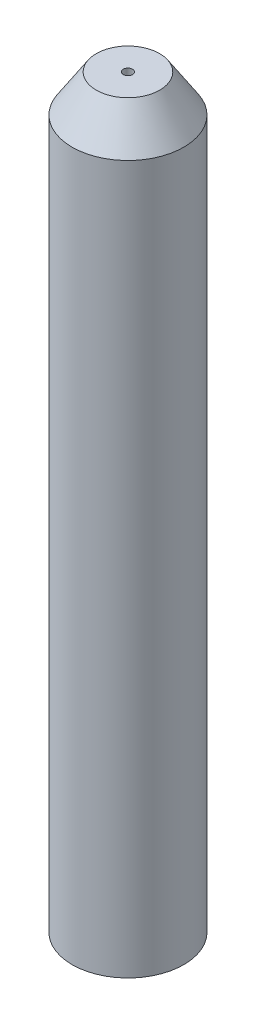
ISO-10303-21;
HEADER;
FILE_DESCRIPTION(('STEP AP214'),'2;1');
FILE_NAME('part.step','',(''),(''),'','','');
FILE_SCHEMA(('AUTOMOTIVE_DESIGN { 1 0 10303 214 1 1 1 1 }'));
ENDSEC;
DATA;
#1=APPLICATION_CONTEXT('core data for automotive mechanical design processes');
#2=APPLICATION_PROTOCOL_DEFINITION('international standard','automotive_design',2000,#1);
#3=PRODUCT_CONTEXT('',#1,'mechanical');
#4=PRODUCT('Part','Part','',(#3));
#5=PRODUCT_RELATED_PRODUCT_CATEGORY('part','',(#4));
#6=PRODUCT_DEFINITION_FORMATION('','',#4);
#7=PRODUCT_DEFINITION_CONTEXT('part definition',#1,'design');
#8=PRODUCT_DEFINITION('design','',#6,#7);
#9=PRODUCT_DEFINITION_SHAPE('','',#8);
#10=(LENGTH_UNIT() NAMED_UNIT(*) SI_UNIT(.MILLI.,.METRE.));
#11=(NAMED_UNIT(*) PLANE_ANGLE_UNIT() SI_UNIT($,.RADIAN.));
#12=(NAMED_UNIT(*) SI_UNIT($,.STERADIAN.) SOLID_ANGLE_UNIT());
#13=UNCERTAINTY_MEASURE_WITH_UNIT(LENGTH_MEASURE(1.E-05),#10,'distance_accuracy_value','');
#14=(GEOMETRIC_REPRESENTATION_CONTEXT(3) GLOBAL_UNCERTAINTY_ASSIGNED_CONTEXT((#13)) GLOBAL_UNIT_ASSIGNED_CONTEXT((#10,
#11,#12)) REPRESENTATION_CONTEXT('',''));
#15=CARTESIAN_POINT('',(0.,0.,0.));
#16=DIRECTION('',(0.,0.,1.));
#17=DIRECTION('',(1.,0.,0.));
#18=AXIS2_PLACEMENT_3D('',#15,#16,#17);
#19=CARTESIAN_POINT('',(0.,40.,0.));
#20=DIRECTION('',(0.,-1.,0.));
#21=DIRECTION('',(0.,0.,1.));
#22=AXIS2_PLACEMENT_3D('',#19,#20,#21);
#23=CONICAL_SURFACE('',#22,0.25,0.0523598775598299);
#24=CARTESIAN_POINT('',(0.,0.,0.));
#25=DIRECTION('',(0.,1.,0.));
#26=DIRECTION('',(0.,0.,1.));
#27=AXIS2_PLACEMENT_3D('',#24,#25,#26);
#28=CIRCLE('',#27,2.34631117132165);
#29=CARTESIAN_POINT('',(0.,0.,2.34631117132165));
#30=VERTEX_POINT('',#29);
#31=EDGE_CURVE('E46',#30,#30,#28,.T.);
#32=ORIENTED_EDGE('',*,*,#31,.F.);
#33=EDGE_LOOP('',(#32));
#34=FACE_BOUND('',#33,.T.);
#35=CARTESIAN_POINT('',(0.,20.,0.));
#36=DIRECTION('',(0.,1.,0.));
#37=DIRECTION('',(0.,0.,1.));
#38=AXIS2_PLACEMENT_3D('',#35,#36,#37);
#39=CIRCLE('',#38,1.29815558566082);
#40=CARTESIAN_POINT('',(0.,20.,1.29815558566082));
#41=VERTEX_POINT('',#40);
#42=EDGE_CURVE('E49',#41,#41,#39,.F.);
#43=ORIENTED_EDGE('',*,*,#42,.F.);
#44=EDGE_LOOP('',(#43));
#45=FACE_BOUND('',#44,.T.);
#46=ADVANCED_FACE('F31',(#34,#45),#23,.F.);
#47=CARTESIAN_POINT('',(0.,40.,0.));
#48=DIRECTION('',(0.,-1.,0.));
#49=DIRECTION('',(0.,0.,-1.));
#50=AXIS2_PLACEMENT_3D('',#47,#48,#49);
#51=CYLINDRICAL_SURFACE('',#50,3.);
#52=CARTESIAN_POINT('',(0.,38.,0.));
#53=DIRECTION('',(0.,1.,0.));
#54=DIRECTION('',(0.,0.,1.));
#55=AXIS2_PLACEMENT_3D('',#52,#53,#54);
#56=CIRCLE('',#55,3.);
#57=CARTESIAN_POINT('',(0.,38.,3.));
#58=VERTEX_POINT('',#57);
#59=EDGE_CURVE('E10',#58,#58,#56,.F.);
#60=ORIENTED_EDGE('',*,*,#59,.T.);
#61=EDGE_LOOP('',(#60));
#62=FACE_BOUND('',#61,.T.);
#63=CARTESIAN_POINT('',(0.,0.,0.));
#64=DIRECTION('',(0.,1.,0.));
#65=DIRECTION('',(0.,0.,1.));
#66=AXIS2_PLACEMENT_3D('',#63,#64,#65);
#67=CIRCLE('',#66,3.);
#68=CARTESIAN_POINT('',(0.,0.,3.));
#69=VERTEX_POINT('',#68);
#70=EDGE_CURVE('E42',#69,#69,#67,.T.);
#71=ORIENTED_EDGE('',*,*,#70,.T.);
#72=EDGE_LOOP('',(#71));
#73=FACE_BOUND('',#72,.T.);
#74=ADVANCED_FACE('F66',(#62,#73),#51,.T.);
#75=CARTESIAN_POINT('',(0.,40.,0.));
#76=DIRECTION('',(0.,1.,0.));
#77=DIRECTION('',(0.,0.,1.));
#78=AXIS2_PLACEMENT_3D('',#75,#76,#77);
#79=PLANE('',#78);
#80=CARTESIAN_POINT('',(0.,40.,0.));
#81=DIRECTION('',(0.,1.,0.));
#82=DIRECTION('',(0.,0.,1.));
#83=AXIS2_PLACEMENT_3D('',#80,#81,#82);
#84=CIRCLE('',#83,1.70118481360497);
#85=CARTESIAN_POINT('',(0.,40.,1.70118481360497));
#86=VERTEX_POINT('',#85);
#87=EDGE_CURVE('E38',#86,#86,#84,.T.);
#88=ORIENTED_EDGE('',*,*,#87,.T.);
#89=EDGE_LOOP('',(#88));
#90=FACE_BOUND('',#89,.T.);
#91=CARTESIAN_POINT('',(0.,40.,0.));
#92=DIRECTION('',(0.,1.,0.));
#93=DIRECTION('',(0.,0.,1.));
#94=AXIS2_PLACEMENT_3D('',#91,#92,#93);
#95=CIRCLE('',#94,0.25);
#96=CARTESIAN_POINT('',(0.,40.,0.25));
#97=VERTEX_POINT('',#96);
#98=EDGE_CURVE('E57',#97,#97,#95,.T.);
#99=ORIENTED_EDGE('',*,*,#98,.F.);
#100=EDGE_LOOP('',(#99));
#101=FACE_BOUND('',#100,.T.);
#102=ADVANCED_FACE('F63',(#90,#101),#79,.T.);
#103=CARTESIAN_POINT('',(0.,0.,0.));
#104=DIRECTION('',(0.,1.,0.));
#105=DIRECTION('',(0.,0.,1.));
#106=AXIS2_PLACEMENT_3D('',#103,#104,#105);
#107=PLANE('',#106);
#108=ORIENTED_EDGE('',*,*,#31,.T.);
#109=EDGE_LOOP('',(#108));
#110=FACE_BOUND('',#109,.T.);
#111=ORIENTED_EDGE('',*,*,#70,.F.);
#112=EDGE_LOOP('',(#111));
#113=FACE_BOUND('',#112,.T.);
#114=ADVANCED_FACE('F65',(#110,#113),#107,.F.);
#115=CARTESIAN_POINT('',(0.,20.,0.));
#116=DIRECTION('',(0.,1.,0.));
#117=DIRECTION('',(0.,0.,1.));
#118=AXIS2_PLACEMENT_3D('',#115,#116,#117);
#119=PLANE('',#118);
#120=CARTESIAN_POINT('',(0.,20.,0.));
#121=DIRECTION('',(0.,1.,0.));
#122=DIRECTION('',(0.,0.,1.));
#123=AXIS2_PLACEMENT_3D('',#120,#121,#122);
#124=CIRCLE('',#123,1.99977327051848);
#125=CARTESIAN_POINT('',(0.,20.,1.99977327051848));
#126=VERTEX_POINT('',#125);
#127=EDGE_CURVE('E51',#126,#126,#124,.T.);
#128=ORIENTED_EDGE('',*,*,#127,.T.);
#129=EDGE_LOOP('',(#128));
#130=FACE_BOUND('',#129,.T.);
#131=ORIENTED_EDGE('',*,*,#42,.T.);
#132=EDGE_LOOP('',(#131));
#133=FACE_BOUND('',#132,.T.);
#134=ADVANCED_FACE('F72',(#130,#133),#119,.T.);
#135=CARTESIAN_POINT('',(0.,40.,0.));
#136=DIRECTION('',(0.,-1.,0.));
#137=DIRECTION('',(0.,0.,1.));
#138=AXIS2_PLACEMENT_3D('',#135,#136,#137);
#139=CONICAL_SURFACE('',#138,0.25,0.0872664625997165);
#140=ORIENTED_EDGE('',*,*,#127,.F.);
#141=EDGE_LOOP('',(#140));
#142=FACE_BOUND('',#141,.T.);
#143=ORIENTED_EDGE('',*,*,#98,.T.);
#144=EDGE_LOOP('',(#143));
#145=FACE_BOUND('',#144,.T.);
#146=ADVANCED_FACE('F61',(#142,#145),#139,.F.);
#147=CARTESIAN_POINT('',(0.,40.,0.));
#148=DIRECTION('',(0.,-1.,0.));
#149=DIRECTION('',(0.,0.,-1.));
#150=AXIS2_PLACEMENT_3D('',#147,#148,#149);
#151=CONICAL_SURFACE('',#150,1.70118481360497,0.575958653158127);
#152=ORIENTED_EDGE('',*,*,#59,.F.);
#153=EDGE_LOOP('',(#152));
#154=FACE_BOUND('',#153,.T.);
#155=ORIENTED_EDGE('',*,*,#87,.F.);
#156=EDGE_LOOP('',(#155));
#157=FACE_BOUND('',#156,.T.);
#158=ADVANCED_FACE('F33',(#154,#157),#151,.T.);
#159=CLOSED_SHELL('',(#46,#74,#102,#114,#134,#146,#158));
#160=MANIFOLD_SOLID_BREP('B2',#159);
#161=ADVANCED_BREP_SHAPE_REPRESENTATION('',(#18,#160),#14);
#162=SHAPE_DEFINITION_REPRESENTATION(#9,#161);
ENDSEC;
END-ISO-10303-21;
